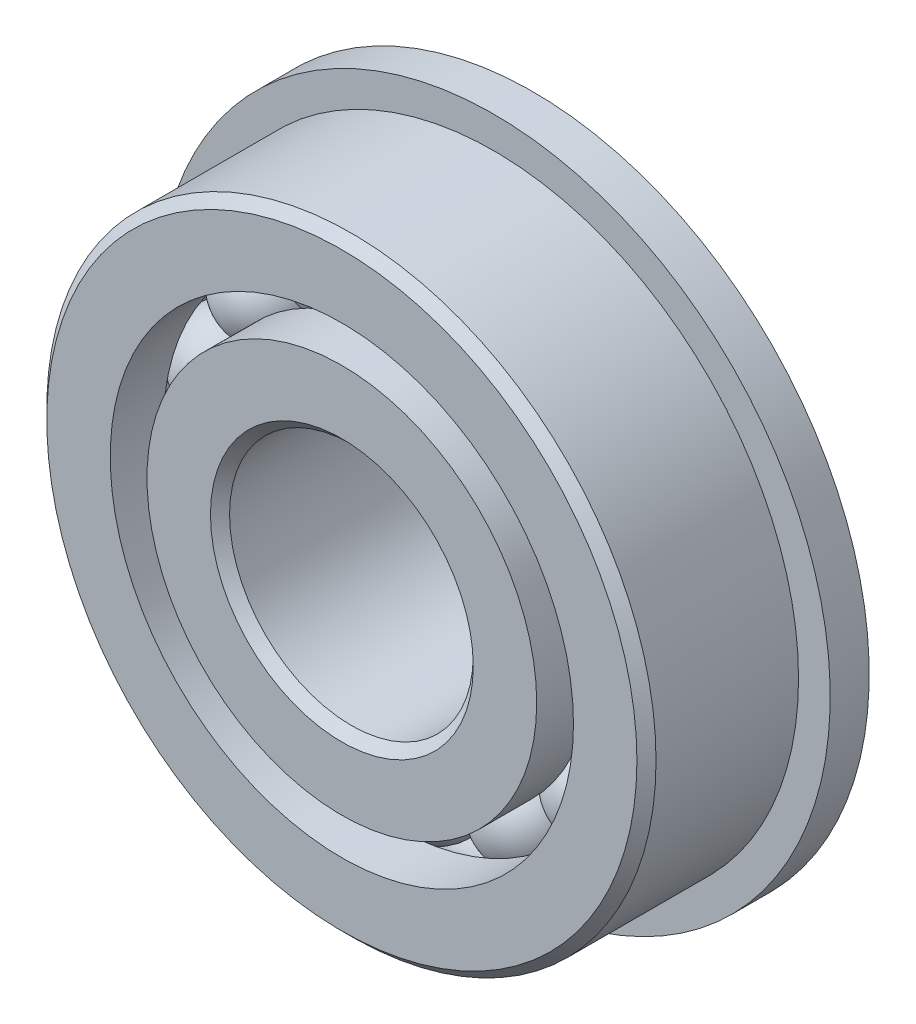
ISO-10303-21;
HEADER;
FILE_DESCRIPTION(('STEP AP214'),'2;1');
FILE_NAME('part.step','',(''),(''),'','','');
FILE_SCHEMA(('AUTOMOTIVE_DESIGN { 1 0 10303 214 1 1 1 1 }'));
ENDSEC;
DATA;
#1=APPLICATION_CONTEXT('core data for automotive mechanical design processes');
#2=APPLICATION_PROTOCOL_DEFINITION('international standard','automotive_design',2000,#1);
#3=PRODUCT_CONTEXT('',#1,'mechanical');
#4=PRODUCT('Part','Part','',(#3));
#5=PRODUCT_RELATED_PRODUCT_CATEGORY('part','',(#4));
#6=PRODUCT_DEFINITION_FORMATION('','',#4);
#7=PRODUCT_DEFINITION_CONTEXT('part definition',#1,'design');
#8=PRODUCT_DEFINITION('design','',#6,#7);
#9=PRODUCT_DEFINITION_SHAPE('','',#8);
#10=(LENGTH_UNIT() NAMED_UNIT(*) SI_UNIT(.MILLI.,.METRE.));
#11=(NAMED_UNIT(*) PLANE_ANGLE_UNIT() SI_UNIT($,.RADIAN.));
#12=(NAMED_UNIT(*) SI_UNIT($,.STERADIAN.) SOLID_ANGLE_UNIT());
#13=UNCERTAINTY_MEASURE_WITH_UNIT(LENGTH_MEASURE(1.E-05),#10,'distance_accuracy_value','');
#14=(GEOMETRIC_REPRESENTATION_CONTEXT(3) GLOBAL_UNCERTAINTY_ASSIGNED_CONTEXT((#13)) GLOBAL_UNIT_ASSIGNED_CONTEXT((#10,
#11,#12)) REPRESENTATION_CONTEXT('',''));
#15=CARTESIAN_POINT('',(0.,0.,0.));
#16=DIRECTION('',(0.,0.,1.));
#17=DIRECTION('',(1.,0.,0.));
#18=AXIS2_PLACEMENT_3D('',#15,#16,#17);
#19=CARTESIAN_POINT('',(-2.41076652547187,5.00600827228285,0.));
#20=DIRECTION('',(0.,0.,1.));
#21=DIRECTION('',(-0.433883739117546,0.900968867902425,0.));
#22=AXIS2_PLACEMENT_3D('',#19,#20,#21);
#23=SPHERICAL_SURFACE('',#22,1.20554465033679);
#24=CARTESIAN_POINT('',(-2.41076652547187,5.00600827228285,1.20554465033679));
#25=VERTEX_POINT('',#24);
#26=VERTEX_LOOP('',#25);
#27=FACE_BOUND('',#26,.T.);
#28=ADVANCED_FACE('F37',(#27),#23,.T.);
#29=CLOSED_SHELL('',(#28));
#30=MANIFOLD_SOLID_BREP('B2',#29);
#31=CARTESIAN_POINT('',(-4.34405117446295,3.46426521157764,0.));
#32=DIRECTION('',(0.,0.,1.));
#33=DIRECTION('',(-0.781831482468022,0.623489801858743,0.));
#34=AXIS2_PLACEMENT_3D('',#31,#32,#33);
#35=SPHERICAL_SURFACE('',#34,1.20554465033679);
#36=CARTESIAN_POINT('',(-4.34405117446295,3.46426521157764,1.20554465033679));
#37=VERTEX_POINT('',#36);
#38=VERTEX_LOOP('',#37);
#39=FACE_BOUND('',#38,.T.);
#40=ADVANCED_FACE('F57',(#39),#35,.T.);
#41=CLOSED_SHELL('',(#40));
#42=MANIFOLD_SOLID_BREP('B6',#41);
#43=CARTESIAN_POINT('',(-5.41694321206024,1.23638193929483,0.));
#44=DIRECTION('',(0.,0.,1.));
#45=DIRECTION('',(-0.974927912181821,0.222520933956325,0.));
#46=AXIS2_PLACEMENT_3D('',#43,#44,#45);
#47=SPHERICAL_SURFACE('',#46,1.20554465033679);
#48=CARTESIAN_POINT('',(-5.41694321206024,1.23638193929483,1.20554465033679));
#49=VERTEX_POINT('',#48);
#50=VERTEX_LOOP('',#49);
#51=FACE_BOUND('',#50,.T.);
#52=ADVANCED_FACE('F77',(#51),#47,.T.);
#53=CLOSED_SHELL('',(#52));
#54=MANIFOLD_SOLID_BREP('B33',#53);
#55=CARTESIAN_POINT('',(-5.41694321206027,-1.23638193929472,0.));
#56=DIRECTION('',(0.,0.,1.));
#57=DIRECTION('',(-0.974927912181826,-0.222520933956305,0.));
#58=AXIS2_PLACEMENT_3D('',#55,#56,#57);
#59=SPHERICAL_SURFACE('',#58,1.20554465033679);
#60=CARTESIAN_POINT('',(-5.41694321206027,-1.23638193929472,1.20554465033679));
#61=VERTEX_POINT('',#60);
#62=VERTEX_LOOP('',#61);
#63=FACE_BOUND('',#62,.T.);
#64=ADVANCED_FACE('F97',(#63),#59,.T.);
#65=CLOSED_SHELL('',(#64));
#66=MANIFOLD_SOLID_BREP('B53',#65);
#67=CARTESIAN_POINT('',(-4.34405117446302,-3.46426521157755,0.));
#68=DIRECTION('',(0.,0.,1.));
#69=DIRECTION('',(-0.781831482468035,-0.623489801858727,0.));
#70=AXIS2_PLACEMENT_3D('',#67,#68,#69);
#71=SPHERICAL_SURFACE('',#70,1.20554465033679);
#72=CARTESIAN_POINT('',(-4.34405117446302,-3.46426521157755,1.20554465033679));
#73=VERTEX_POINT('',#72);
#74=VERTEX_LOOP('',#73);
#75=FACE_BOUND('',#74,.T.);
#76=ADVANCED_FACE('F117',(#75),#71,.T.);
#77=CLOSED_SHELL('',(#76));
#78=MANIFOLD_SOLID_BREP('B73',#77);
#79=CARTESIAN_POINT('',(-2.41076652547197,-5.0060082722828,0.));
#80=DIRECTION('',(0.,0.,1.));
#81=DIRECTION('',(-0.433883739117565,-0.900968867902416,0.));
#82=AXIS2_PLACEMENT_3D('',#79,#80,#81);
#83=SPHERICAL_SURFACE('',#82,1.20554465033679);
#84=CARTESIAN_POINT('',(-2.41076652547197,-5.0060082722828,1.20554465033679));
#85=VERTEX_POINT('',#84);
#86=VERTEX_LOOP('',#85);
#87=FACE_BOUND('',#86,.T.);
#88=ADVANCED_FACE('F137',(#87),#83,.T.);
#89=CLOSED_SHELL('',(#88));
#90=MANIFOLD_SOLID_BREP('B93',#89);
#91=CARTESIAN_POINT('',(0.,-5.55625,0.));
#92=DIRECTION('',(0.,0.,1.));
#93=DIRECTION('',(0.,-1.,0.));
#94=AXIS2_PLACEMENT_3D('',#91,#92,#93);
#95=SPHERICAL_SURFACE('',#94,1.20554465033679);
#96=CARTESIAN_POINT('',(0.,-5.55625,1.20554465033679));
#97=VERTEX_POINT('',#96);
#98=VERTEX_LOOP('',#97);
#99=FACE_BOUND('',#98,.T.);
#100=ADVANCED_FACE('F157',(#99),#95,.T.);
#101=CLOSED_SHELL('',(#100));
#102=MANIFOLD_SOLID_BREP('B113',#101);
#103=CARTESIAN_POINT('',(2.4107665254719,-5.00600827228283,0.));
#104=DIRECTION('',(0.,0.,1.));
#105=DIRECTION('',(0.433883739117553,-0.900968867902422,0.));
#106=AXIS2_PLACEMENT_3D('',#103,#104,#105);
#107=SPHERICAL_SURFACE('',#106,1.20554465033679);
#108=CARTESIAN_POINT('',(2.4107665254719,-5.00600827228283,1.20554465033679));
#109=VERTEX_POINT('',#108);
#110=VERTEX_LOOP('',#109);
#111=FACE_BOUND('',#110,.T.);
#112=ADVANCED_FACE('F177',(#111),#107,.T.);
#113=CLOSED_SHELL('',(#112));
#114=MANIFOLD_SOLID_BREP('B133',#113);
#115=CARTESIAN_POINT('',(4.34405117446297,-3.46426521157761,0.));
#116=DIRECTION('',(0.,0.,1.));
#117=DIRECTION('',(0.781831482468027,-0.623489801858737,0.));
#118=AXIS2_PLACEMENT_3D('',#115,#116,#117);
#119=SPHERICAL_SURFACE('',#118,1.20554465033679);
#120=CARTESIAN_POINT('',(4.34405117446297,-3.46426521157761,1.20554465033679));
#121=VERTEX_POINT('',#120);
#122=VERTEX_LOOP('',#121);
#123=FACE_BOUND('',#122,.T.);
#124=ADVANCED_FACE('F197',(#123),#119,.T.);
#125=CLOSED_SHELL('',(#124));
#126=MANIFOLD_SOLID_BREP('B153',#125);
#127=CARTESIAN_POINT('',(5.41694321206025,-1.23638193929479,0.));
#128=DIRECTION('',(0.,0.,1.));
#129=DIRECTION('',(0.974927912181823,-0.222520933956318,0.));
#130=AXIS2_PLACEMENT_3D('',#127,#128,#129);
#131=SPHERICAL_SURFACE('',#130,1.20554465033679);
#132=CARTESIAN_POINT('',(5.41694321206025,-1.23638193929479,1.20554465033679));
#133=VERTEX_POINT('',#132);
#134=VERTEX_LOOP('',#133);
#135=FACE_BOUND('',#134,.T.);
#136=ADVANCED_FACE('F217',(#135),#131,.T.);
#137=CLOSED_SHELL('',(#136));
#138=MANIFOLD_SOLID_BREP('B173',#137);
#139=CARTESIAN_POINT('',(5.41694321206026,1.23638193929476,0.));
#140=DIRECTION('',(0.,0.,1.));
#141=DIRECTION('',(0.974927912181824,0.222520933956311,0.));
#142=AXIS2_PLACEMENT_3D('',#139,#140,#141);
#143=SPHERICAL_SURFACE('',#142,1.20554465033679);
#144=CARTESIAN_POINT('',(5.41694321206026,1.23638193929476,1.20554465033679));
#145=VERTEX_POINT('',#144);
#146=VERTEX_LOOP('',#145);
#147=FACE_BOUND('',#146,.T.);
#148=ADVANCED_FACE('F237',(#147),#143,.T.);
#149=CLOSED_SHELL('',(#148));
#150=MANIFOLD_SOLID_BREP('B193',#149);
#151=CARTESIAN_POINT('',(4.344051174463,3.46426521157758,0.));
#152=DIRECTION('',(0.,0.,1.));
#153=DIRECTION('',(0.781831482468031,0.623489801858732,0.));
#154=AXIS2_PLACEMENT_3D('',#151,#152,#153);
#155=SPHERICAL_SURFACE('',#154,1.20554465033679);
#156=CARTESIAN_POINT('',(4.344051174463,3.46426521157758,1.20554465033679));
#157=VERTEX_POINT('',#156);
#158=VERTEX_LOOP('',#157);
#159=FACE_BOUND('',#158,.T.);
#160=ADVANCED_FACE('F257',(#159),#155,.T.);
#161=CLOSED_SHELL('',(#160));
#162=MANIFOLD_SOLID_BREP('B213',#161);
#163=CARTESIAN_POINT('',(2.41076652547194,5.00600827228281,0.));
#164=DIRECTION('',(0.,0.,1.));
#165=DIRECTION('',(0.433883739117559,0.900968867902419,0.));
#166=AXIS2_PLACEMENT_3D('',#163,#164,#165);
#167=SPHERICAL_SURFACE('',#166,1.20554465033679);
#168=CARTESIAN_POINT('',(2.41076652547194,5.00600827228281,1.20554465033679));
#169=VERTEX_POINT('',#168);
#170=VERTEX_LOOP('',#169);
#171=FACE_BOUND('',#170,.T.);
#172=ADVANCED_FACE('F277',(#171),#167,.T.);
#173=CLOSED_SHELL('',(#172));
#174=MANIFOLD_SOLID_BREP('B233',#173);
#175=CARTESIAN_POINT('',(0.,5.55625,0.));
#176=DIRECTION('',(0.,0.,1.));
#177=DIRECTION('',(0.,1.,0.));
#178=AXIS2_PLACEMENT_3D('',#175,#176,#177);
#179=SPHERICAL_SURFACE('',#178,1.20554465033679);
#180=CARTESIAN_POINT('',(0.,5.55625,1.20554465033679));
#181=VERTEX_POINT('',#180);
#182=VERTEX_LOOP('',#181);
#183=FACE_BOUND('',#182,.T.);
#184=ADVANCED_FACE('F299',(#183),#179,.T.);
#185=CLOSED_SHELL('',(#184));
#186=MANIFOLD_SOLID_BREP('B253',#185);
#187=CARTESIAN_POINT('',(0.,5.07727857142857,2.4892));
#188=DIRECTION('',(0.,0.,-1.));
#189=DIRECTION('',(-1.,0.,0.));
#190=AXIS2_PLACEMENT_3D('',#187,#188,#189);
#191=PLANE('',#190);
#192=CARTESIAN_POINT('',(0.,0.,2.4892));
#193=DIRECTION('',(0.,0.,1.));
#194=DIRECTION('',(1.,0.,0.));
#195=AXIS2_PLACEMENT_3D('',#192,#193,#194);
#196=CIRCLE('',#195,3.42392);
#197=CARTESIAN_POINT('',(3.42392,0.,2.4892));
#198=VERTEX_POINT('',#197);
#199=EDGE_CURVE('E346',#198,#198,#196,.T.);
#200=ORIENTED_EDGE('',*,*,#199,.F.);
#201=EDGE_LOOP('',(#200));
#202=FACE_BOUND('',#201,.T.);
#203=CARTESIAN_POINT('',(0.,0.,2.4892));
#204=DIRECTION('',(0.,0.,1.));
#205=DIRECTION('',(1.,0.,0.));
#206=AXIS2_PLACEMENT_3D('',#203,#204,#205);
#207=CIRCLE('',#206,5.07727857142857);
#208=CARTESIAN_POINT('',(5.07727857142857,0.,2.4892));
#209=VERTEX_POINT('',#208);
#210=EDGE_CURVE('E298',#209,#209,#207,.T.);
#211=ORIENTED_EDGE('',*,*,#210,.T.);
#212=EDGE_LOOP('',(#211));
#213=FACE_BOUND('',#212,.T.);
#214=ADVANCED_FACE('F318',(#202,#213),#191,.F.);
#215=CARTESIAN_POINT('',(0.,0.,2.4892));
#216=DIRECTION('',(0.,0.,1.));
#217=DIRECTION('',(1.,0.,0.));
#218=AXIS2_PLACEMENT_3D('',#215,#216,#217);
#219=CYLINDRICAL_SURFACE('',#218,5.07727857142857);
#220=ORIENTED_EDGE('',*,*,#210,.F.);
#221=EDGE_LOOP('',(#220));
#222=FACE_BOUND('',#221,.T.);
#223=CARTESIAN_POINT('',(0.,0.,1.10631111111111));
#224=DIRECTION('',(0.,0.,1.));
#225=DIRECTION('',(1.,0.,0.));
#226=AXIS2_PLACEMENT_3D('',#223,#224,#225);
#227=CIRCLE('',#226,5.07727857142857);
#228=CARTESIAN_POINT('',(5.07727857142857,0.,1.10631111111111));
#229=VERTEX_POINT('',#228);
#230=EDGE_CURVE('E324',#229,#229,#227,.T.);
#231=ORIENTED_EDGE('',*,*,#230,.T.);
#232=EDGE_LOOP('',(#231));
#233=FACE_BOUND('',#232,.T.);
#234=ADVANCED_FACE('F353',(#222,#233),#219,.T.);
#235=CARTESIAN_POINT('',(0.,0.,0.));
#236=DIRECTION('',(0.,0.,1.));
#237=DIRECTION('',(1.,0.,0.));
#238=AXIS2_PLACEMENT_3D('',#235,#236,#237);
#239=TOROIDAL_SURFACE('',#238,5.55625,1.20554465033679);
#240=ORIENTED_EDGE('',*,*,#230,.F.);
#241=EDGE_LOOP('',(#240));
#242=FACE_BOUND('',#241,.T.);
#243=CARTESIAN_POINT('',(0.,0.,-1.10631111111111));
#244=DIRECTION('',(0.,0.,1.));
#245=DIRECTION('',(1.,0.,0.));
#246=AXIS2_PLACEMENT_3D('',#243,#244,#245);
#247=CIRCLE('',#246,5.07727857142857);
#248=CARTESIAN_POINT('',(5.07727857142857,0.,-1.10631111111111));
#249=VERTEX_POINT('',#248);
#250=EDGE_CURVE('E328',#249,#249,#247,.T.);
#251=ORIENTED_EDGE('',*,*,#250,.T.);
#252=EDGE_LOOP('',(#251));
#253=FACE_BOUND('',#252,.T.);
#254=ADVANCED_FACE('F357',(#242,#253),#239,.F.);
#255=CARTESIAN_POINT('',(0.,0.,2.4892));
#256=DIRECTION('',(0.,0.,1.));
#257=DIRECTION('',(1.,0.,0.));
#258=AXIS2_PLACEMENT_3D('',#255,#256,#257);
#259=CYLINDRICAL_SURFACE('',#258,5.07727857142857);
#260=ORIENTED_EDGE('',*,*,#250,.F.);
#261=EDGE_LOOP('',(#260));
#262=FACE_BOUND('',#261,.T.);
#263=CARTESIAN_POINT('',(0.,0.,-2.4892));
#264=DIRECTION('',(0.,0.,1.));
#265=DIRECTION('',(1.,0.,0.));
#266=AXIS2_PLACEMENT_3D('',#263,#264,#265);
#267=CIRCLE('',#266,5.07727857142857);
#268=CARTESIAN_POINT('',(5.07727857142857,0.,-2.4892));
#269=VERTEX_POINT('',#268);
#270=EDGE_CURVE('E332',#269,#269,#267,.T.);
#271=ORIENTED_EDGE('',*,*,#270,.T.);
#272=EDGE_LOOP('',(#271));
#273=FACE_BOUND('',#272,.T.);
#274=ADVANCED_FACE('F362',(#262,#273),#259,.T.);
#275=CARTESIAN_POINT('',(0.,3.42392,-2.4892));
#276=DIRECTION('',(0.,0.,1.));
#277=DIRECTION('',(1.,0.,0.));
#278=AXIS2_PLACEMENT_3D('',#275,#276,#277);
#279=PLANE('',#278);
#280=ORIENTED_EDGE('',*,*,#270,.F.);
#281=EDGE_LOOP('',(#280));
#282=FACE_BOUND('',#281,.T.);
#283=CARTESIAN_POINT('',(0.,0.,-2.4892));
#284=DIRECTION('',(0.,0.,1.));
#285=DIRECTION('',(1.,0.,0.));
#286=AXIS2_PLACEMENT_3D('',#283,#284,#285);
#287=CIRCLE('',#286,3.42392);
#288=CARTESIAN_POINT('',(3.42392,0.,-2.4892));
#289=VERTEX_POINT('',#288);
#290=EDGE_CURVE('E337',#289,#289,#287,.T.);
#291=ORIENTED_EDGE('',*,*,#290,.T.);
#292=EDGE_LOOP('',(#291));
#293=FACE_BOUND('',#292,.T.);
#294=ADVANCED_FACE('F368',(#282,#293),#279,.F.);
#295=CARTESIAN_POINT('',(0.,0.,-2.24028));
#296=DIRECTION('',(0.,0.,-1.));
#297=DIRECTION('',(-1.,0.,0.));
#298=AXIS2_PLACEMENT_3D('',#295,#296,#297);
#299=CONICAL_SURFACE('',#298,3.175,0.785398163397448);
#300=ORIENTED_EDGE('',*,*,#290,.F.);
#301=EDGE_LOOP('',(#300));
#302=FACE_BOUND('',#301,.T.);
#303=CARTESIAN_POINT('',(0.,0.,-2.24028));
#304=DIRECTION('',(0.,0.,1.));
#305=DIRECTION('',(1.,0.,0.));
#306=AXIS2_PLACEMENT_3D('',#303,#304,#305);
#307=CIRCLE('',#306,3.175);
#308=CARTESIAN_POINT('',(3.175,0.,-2.24028));
#309=VERTEX_POINT('',#308);
#310=EDGE_CURVE('E340',#309,#309,#307,.T.);
#311=ORIENTED_EDGE('',*,*,#310,.T.);
#312=EDGE_LOOP('',(#311));
#313=FACE_BOUND('',#312,.T.);
#314=ADVANCED_FACE('F372',(#302,#313),#299,.F.);
#315=CARTESIAN_POINT('',(0.,0.,2.4892));
#316=DIRECTION('',(0.,0.,1.));
#317=DIRECTION('',(1.,0.,0.));
#318=AXIS2_PLACEMENT_3D('',#315,#316,#317);
#319=CYLINDRICAL_SURFACE('',#318,3.175);
#320=ORIENTED_EDGE('',*,*,#310,.F.);
#321=EDGE_LOOP('',(#320));
#322=FACE_BOUND('',#321,.T.);
#323=CARTESIAN_POINT('',(0.,0.,2.24028));
#324=DIRECTION('',(0.,0.,1.));
#325=DIRECTION('',(1.,0.,0.));
#326=AXIS2_PLACEMENT_3D('',#323,#324,#325);
#327=CIRCLE('',#326,3.175);
#328=CARTESIAN_POINT('',(3.175,0.,2.24028));
#329=VERTEX_POINT('',#328);
#330=EDGE_CURVE('E343',#329,#329,#327,.T.);
#331=ORIENTED_EDGE('',*,*,#330,.T.);
#332=EDGE_LOOP('',(#331));
#333=FACE_BOUND('',#332,.T.);
#334=ADVANCED_FACE('F376',(#322,#333),#319,.F.);
#335=CARTESIAN_POINT('',(0.,0.,2.4892));
#336=DIRECTION('',(0.,0.,1.));
#337=DIRECTION('',(1.,0.,0.));
#338=AXIS2_PLACEMENT_3D('',#335,#336,#337);
#339=CONICAL_SURFACE('',#338,3.42392,0.785398163397447);
#340=ORIENTED_EDGE('',*,*,#330,.F.);
#341=EDGE_LOOP('',(#340));
#342=FACE_BOUND('',#341,.T.);
#343=ORIENTED_EDGE('',*,*,#199,.T.);
#344=EDGE_LOOP('',(#343));
#345=FACE_BOUND('',#344,.T.);
#346=ADVANCED_FACE('F350',(#342,#345),#339,.F.);
#347=CLOSED_SHELL('',(#214,#234,#254,#274,#294,#314,#334,#346));
#348=MANIFOLD_SOLID_BREP('B273',#347);
#349=CARTESIAN_POINT('',(0.,0.,2.24028));
#350=DIRECTION('',(0.,0.,-1.));
#351=DIRECTION('',(-1.,0.,0.));
#352=AXIS2_PLACEMENT_3D('',#349,#350,#351);
#353=CONICAL_SURFACE('',#352,7.9375,0.785398163397447);
#354=CARTESIAN_POINT('',(0.,0.,2.4892));
#355=DIRECTION('',(0.,0.,1.));
#356=DIRECTION('',(1.,0.,0.));
#357=AXIS2_PLACEMENT_3D('',#354,#355,#356);
#358=CIRCLE('',#357,7.68858);
#359=CARTESIAN_POINT('',(7.68858,0.,2.4892));
#360=VERTEX_POINT('',#359);
#361=EDGE_CURVE('E461',#360,#360,#358,.T.);
#362=ORIENTED_EDGE('',*,*,#361,.F.);
#363=EDGE_LOOP('',(#362));
#364=FACE_BOUND('',#363,.T.);
#365=CARTESIAN_POINT('',(0.,0.,2.24028));
#366=DIRECTION('',(0.,0.,1.));
#367=DIRECTION('',(1.,0.,0.));
#368=AXIS2_PLACEMENT_3D('',#365,#366,#367);
#369=CIRCLE('',#368,7.9375);
#370=CARTESIAN_POINT('',(7.9375,0.,2.24028));
#371=VERTEX_POINT('',#370);
#372=EDGE_CURVE('E317',#371,#371,#369,.T.);
#373=ORIENTED_EDGE('',*,*,#372,.T.);
#374=EDGE_LOOP('',(#373));
#375=FACE_BOUND('',#374,.T.);
#376=ADVANCED_FACE('F439',(#364,#375),#353,.T.);
#377=CARTESIAN_POINT('',(0.,0.,2.4892));
#378=DIRECTION('',(0.,0.,1.));
#379=DIRECTION('',(1.,0.,0.));
#380=AXIS2_PLACEMENT_3D('',#377,#378,#379);
#381=CYLINDRICAL_SURFACE('',#380,7.9375);
#382=CARTESIAN_POINT('',(0.,0.,-1.4732));
#383=DIRECTION('',(0.,0.,1.));
#384=DIRECTION('',(1.,0.,0.));
#385=AXIS2_PLACEMENT_3D('',#382,#383,#384);
#386=CIRCLE('',#385,7.9375);
#387=CARTESIAN_POINT('',(7.9375,0.,-1.4732));
#388=VERTEX_POINT('',#387);
#389=EDGE_CURVE('E442',#388,#388,#386,.T.);
#390=ORIENTED_EDGE('',*,*,#389,.T.);
#391=EDGE_LOOP('',(#390));
#392=FACE_BOUND('',#391,.T.);
#393=ORIENTED_EDGE('',*,*,#372,.F.);
#394=EDGE_LOOP('',(#393));
#395=FACE_BOUND('',#394,.T.);
#396=ADVANCED_FACE('F482',(#392,#395),#381,.T.);
#397=CARTESIAN_POINT('',(0.,7.68858,-2.4892));
#398=DIRECTION('',(0.,0.,1.));
#399=DIRECTION('',(1.,0.,0.));
#400=AXIS2_PLACEMENT_3D('',#397,#398,#399);
#401=PLANE('',#400);
#402=CARTESIAN_POINT('',(0.,0.,-2.4892));
#403=DIRECTION('',(0.,0.,1.));
#404=DIRECTION('',(1.,0.,0.));
#405=AXIS2_PLACEMENT_3D('',#402,#403,#404);
#406=CIRCLE('',#405,6.03522142857143);
#407=CARTESIAN_POINT('',(6.03522142857143,0.,-2.4892));
#408=VERTEX_POINT('',#407);
#409=EDGE_CURVE('E446',#408,#408,#406,.T.);
#410=ORIENTED_EDGE('',*,*,#409,.T.);
#411=EDGE_LOOP('',(#410));
#412=FACE_BOUND('',#411,.T.);
#413=CARTESIAN_POINT('',(0.,0.,-2.4892));
#414=DIRECTION('',(0.,0.,-1.));
#415=DIRECTION('',(-1.,0.,0.));
#416=AXIS2_PLACEMENT_3D('',#413,#414,#415);
#417=CIRCLE('',#416,8.763);
#418=CARTESIAN_POINT('',(-8.763,0.,-2.4892));
#419=VERTEX_POINT('',#418);
#420=EDGE_CURVE('E464',#419,#419,#417,.T.);
#421=ORIENTED_EDGE('',*,*,#420,.T.);
#422=EDGE_LOOP('',(#421));
#423=FACE_BOUND('',#422,.T.);
#424=ADVANCED_FACE('F485',(#412,#423),#401,.F.);
#425=CARTESIAN_POINT('',(0.,0.,2.4892));
#426=DIRECTION('',(0.,0.,1.));
#427=DIRECTION('',(1.,0.,0.));
#428=AXIS2_PLACEMENT_3D('',#425,#426,#427);
#429=CYLINDRICAL_SURFACE('',#428,6.03522142857143);
#430=ORIENTED_EDGE('',*,*,#409,.F.);
#431=EDGE_LOOP('',(#430));
#432=FACE_BOUND('',#431,.T.);
#433=CARTESIAN_POINT('',(0.,0.,-1.10631111111111));
#434=DIRECTION('',(0.,0.,1.));
#435=DIRECTION('',(1.,0.,0.));
#436=AXIS2_PLACEMENT_3D('',#433,#434,#435);
#437=CIRCLE('',#436,6.03522142857143);
#438=CARTESIAN_POINT('',(6.03522142857143,0.,-1.10631111111111));
#439=VERTEX_POINT('',#438);
#440=EDGE_CURVE('E450',#439,#439,#437,.T.);
#441=ORIENTED_EDGE('',*,*,#440,.T.);
#442=EDGE_LOOP('',(#441));
#443=FACE_BOUND('',#442,.T.);
#444=ADVANCED_FACE('F490',(#432,#443),#429,.F.);
#445=CARTESIAN_POINT('',(0.,0.,0.));
#446=DIRECTION('',(0.,0.,1.));
#447=DIRECTION('',(1.,0.,0.));
#448=AXIS2_PLACEMENT_3D('',#445,#446,#447);
#449=TOROIDAL_SURFACE('',#448,5.55625,1.20554465033679);
#450=ORIENTED_EDGE('',*,*,#440,.F.);
#451=EDGE_LOOP('',(#450));
#452=FACE_BOUND('',#451,.T.);
#453=CARTESIAN_POINT('',(0.,0.,1.10631111111111));
#454=DIRECTION('',(0.,0.,1.));
#455=DIRECTION('',(1.,0.,0.));
#456=AXIS2_PLACEMENT_3D('',#453,#454,#455);
#457=CIRCLE('',#456,6.03522142857143);
#458=CARTESIAN_POINT('',(6.03522142857143,0.,1.10631111111111));
#459=VERTEX_POINT('',#458);
#460=EDGE_CURVE('E455',#459,#459,#457,.T.);
#461=ORIENTED_EDGE('',*,*,#460,.T.);
#462=EDGE_LOOP('',(#461));
#463=FACE_BOUND('',#462,.T.);
#464=ADVANCED_FACE('F497',(#452,#463),#449,.F.);
#465=CARTESIAN_POINT('',(0.,0.,2.4892));
#466=DIRECTION('',(0.,0.,1.));
#467=DIRECTION('',(1.,0.,0.));
#468=AXIS2_PLACEMENT_3D('',#465,#466,#467);
#469=CYLINDRICAL_SURFACE('',#468,6.03522142857143);
#470=ORIENTED_EDGE('',*,*,#460,.F.);
#471=EDGE_LOOP('',(#470));
#472=FACE_BOUND('',#471,.T.);
#473=CARTESIAN_POINT('',(0.,0.,2.4892));
#474=DIRECTION('',(0.,0.,1.));
#475=DIRECTION('',(1.,0.,0.));
#476=AXIS2_PLACEMENT_3D('',#473,#474,#475);
#477=CIRCLE('',#476,6.03522142857143);
#478=CARTESIAN_POINT('',(6.03522142857143,0.,2.4892));
#479=VERTEX_POINT('',#478);
#480=EDGE_CURVE('E458',#479,#479,#477,.T.);
#481=ORIENTED_EDGE('',*,*,#480,.T.);
#482=EDGE_LOOP('',(#481));
#483=FACE_BOUND('',#482,.T.);
#484=ADVANCED_FACE('F501',(#472,#483),#469,.F.);
#485=CARTESIAN_POINT('',(0.,7.68858,2.4892));
#486=DIRECTION('',(0.,0.,-1.));
#487=DIRECTION('',(-1.,0.,0.));
#488=AXIS2_PLACEMENT_3D('',#485,#486,#487);
#489=PLANE('',#488);
#490=ORIENTED_EDGE('',*,*,#480,.F.);
#491=EDGE_LOOP('',(#490));
#492=FACE_BOUND('',#491,.T.);
#493=ORIENTED_EDGE('',*,*,#361,.T.);
#494=EDGE_LOOP('',(#493));
#495=FACE_BOUND('',#494,.T.);
#496=ADVANCED_FACE('F477',(#492,#495),#489,.F.);
#497=CARTESIAN_POINT('',(0.,6.86190071428571,-1.4732));
#498=DIRECTION('',(0.,0.,1.));
#499=DIRECTION('',(1.,0.,0.));
#500=AXIS2_PLACEMENT_3D('',#497,#498,#499);
#501=PLANE('',#500);
#502=CARTESIAN_POINT('',(0.,0.,-1.4732));
#503=DIRECTION('',(0.,0.,-1.));
#504=DIRECTION('',(-1.,0.,0.));
#505=AXIS2_PLACEMENT_3D('',#502,#503,#504);
#506=CIRCLE('',#505,8.763);
#507=CARTESIAN_POINT('',(-8.763,0.,-1.4732));
#508=VERTEX_POINT('',#507);
#509=EDGE_CURVE('E467',#508,#508,#506,.T.);
#510=ORIENTED_EDGE('',*,*,#509,.F.);
#511=EDGE_LOOP('',(#510));
#512=FACE_BOUND('',#511,.T.);
#513=ORIENTED_EDGE('',*,*,#389,.F.);
#514=EDGE_LOOP('',(#513));
#515=FACE_BOUND('',#514,.T.);
#516=ADVANCED_FACE('F474',(#512,#515),#501,.T.);
#517=CARTESIAN_POINT('',(0.,0.,-2.4892));
#518=DIRECTION('',(0.,0.,-1.));
#519=DIRECTION('',(-1.,0.,0.));
#520=AXIS2_PLACEMENT_3D('',#517,#518,#519);
#521=CYLINDRICAL_SURFACE('',#520,8.763);
#522=ORIENTED_EDGE('',*,*,#509,.T.);
#523=EDGE_LOOP('',(#522));
#524=FACE_BOUND('',#523,.T.);
#525=ORIENTED_EDGE('',*,*,#420,.F.);
#526=EDGE_LOOP('',(#525));
#527=FACE_BOUND('',#526,.T.);
#528=ADVANCED_FACE('F471',(#524,#527),#521,.T.);
#529=CLOSED_SHELL('',(#376,#396,#424,#444,#464,#484,#496,#516,#528));
#530=MANIFOLD_SOLID_BREP('B293',#529);
#531=ADVANCED_BREP_SHAPE_REPRESENTATION('',(#18,#30,#42,#54,#66,#78,#90,#102,#114,#126,#138,
#150,#162,#174,#186,#348,#530),#14);
#532=SHAPE_DEFINITION_REPRESENTATION(#9,#531);
ENDSEC;
END-ISO-10303-21;
